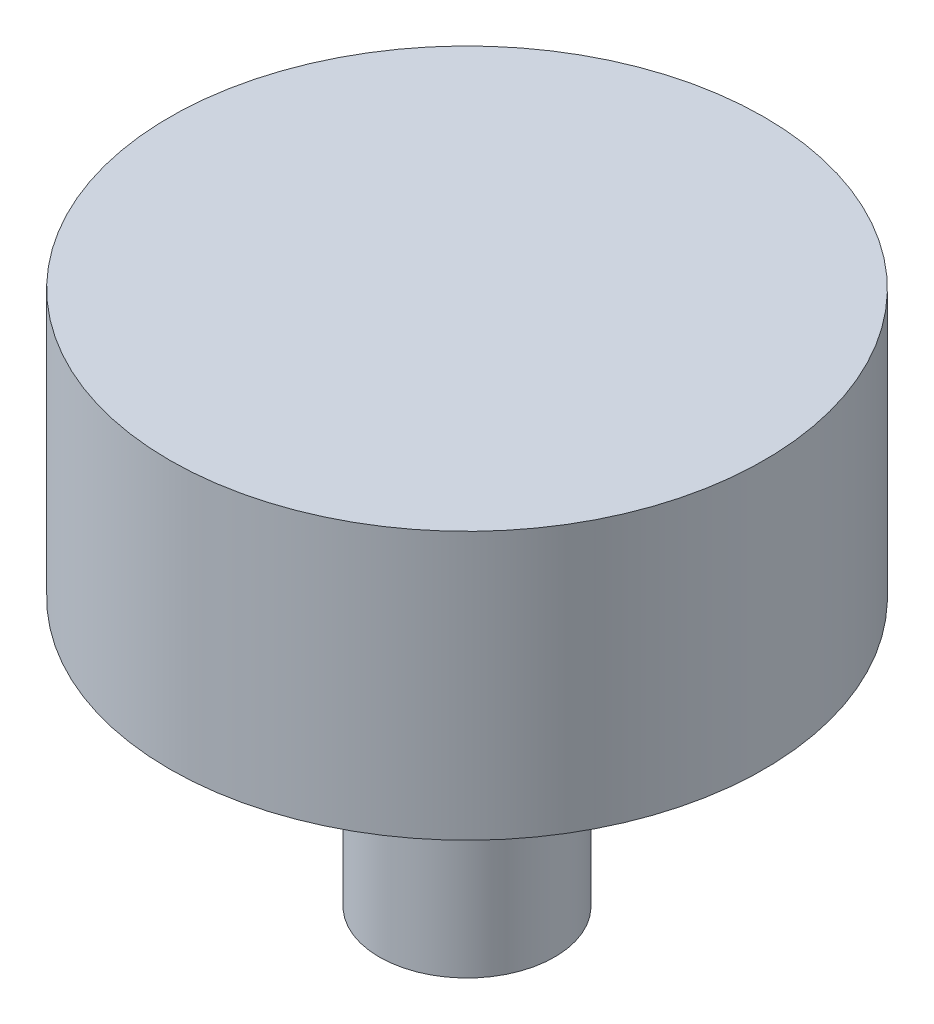
ISO-10303-21;
HEADER;
FILE_DESCRIPTION(('STEP AP214'),'2;1');
FILE_NAME('part.step','',(''),(''),'','','');
FILE_SCHEMA(('AUTOMOTIVE_DESIGN { 1 0 10303 214 1 1 1 1 }'));
ENDSEC;
DATA;
#1=APPLICATION_CONTEXT('core data for automotive mechanical design processes');
#2=APPLICATION_PROTOCOL_DEFINITION('international standard','automotive_design',2000,#1);
#3=PRODUCT_CONTEXT('',#1,'mechanical');
#4=PRODUCT('Part','Part','',(#3));
#5=PRODUCT_RELATED_PRODUCT_CATEGORY('part','',(#4));
#6=PRODUCT_DEFINITION_FORMATION('','',#4);
#7=PRODUCT_DEFINITION_CONTEXT('part definition',#1,'design');
#8=PRODUCT_DEFINITION('design','',#6,#7);
#9=PRODUCT_DEFINITION_SHAPE('','',#8);
#10=(LENGTH_UNIT() NAMED_UNIT(*) SI_UNIT(.MILLI.,.METRE.));
#11=(NAMED_UNIT(*) PLANE_ANGLE_UNIT() SI_UNIT($,.RADIAN.));
#12=(NAMED_UNIT(*) SI_UNIT($,.STERADIAN.) SOLID_ANGLE_UNIT());
#13=UNCERTAINTY_MEASURE_WITH_UNIT(LENGTH_MEASURE(1.E-05),#10,'distance_accuracy_value','');
#14=(GEOMETRIC_REPRESENTATION_CONTEXT(3) GLOBAL_UNCERTAINTY_ASSIGNED_CONTEXT((#13)) GLOBAL_UNIT_ASSIGNED_CONTEXT((#10,
#11,#12)) REPRESENTATION_CONTEXT('',''));
#15=CARTESIAN_POINT('',(0.,0.,0.));
#16=DIRECTION('',(0.,0.,1.));
#17=DIRECTION('',(1.,0.,0.));
#18=AXIS2_PLACEMENT_3D('',#15,#16,#17);
#19=CARTESIAN_POINT('',(0.,0.,0.));
#20=DIRECTION('',(0.,1.,0.));
#21=DIRECTION('',(0.,0.,1.));
#22=AXIS2_PLACEMENT_3D('',#19,#20,#21);
#23=PLANE('',#22);
#24=CARTESIAN_POINT('',(0.,0.,0.));
#25=DIRECTION('',(0.,1.,0.));
#26=DIRECTION('',(0.,0.,1.));
#27=AXIS2_PLACEMENT_3D('',#24,#25,#26);
#28=CIRCLE('',#27,2.95);
#29=CARTESIAN_POINT('',(0.,0.,2.95));
#30=VERTEX_POINT('',#29);
#31=EDGE_CURVE('E37',#30,#30,#28,.T.);
#32=ORIENTED_EDGE('',*,*,#31,.F.);
#33=EDGE_LOOP('',(#32));
#34=FACE_BOUND('',#33,.T.);
#35=CARTESIAN_POINT('',(0.,0.,0.));
#36=DIRECTION('',(0.,1.,0.));
#37=DIRECTION('',(0.,0.,1.));
#38=AXIS2_PLACEMENT_3D('',#35,#36,#37);
#39=CIRCLE('',#38,2.2);
#40=CARTESIAN_POINT('',(0.,0.,2.2));
#41=VERTEX_POINT('',#40);
#42=EDGE_CURVE('E44',#41,#41,#39,.T.);
#43=ORIENTED_EDGE('',*,*,#42,.T.);
#44=EDGE_LOOP('',(#43));
#45=FACE_BOUND('',#44,.T.);
#46=ADVANCED_FACE('F33',(#34,#45),#23,.F.);
#47=CARTESIAN_POINT('',(0.,9.,0.));
#48=DIRECTION('',(0.,-1.,0.));
#49=DIRECTION('',(0.,0.,-1.));
#50=AXIS2_PLACEMENT_3D('',#47,#48,#49);
#51=CYLINDRICAL_SURFACE('',#50,2.95);
#52=CARTESIAN_POINT('',(0.,9.,0.));
#53=DIRECTION('',(0.,1.,0.));
#54=DIRECTION('',(0.,0.,1.));
#55=AXIS2_PLACEMENT_3D('',#52,#53,#54);
#56=CIRCLE('',#55,2.95);
#57=CARTESIAN_POINT('',(0.,9.,2.95));
#58=VERTEX_POINT('',#57);
#59=EDGE_CURVE('E10',#58,#58,#56,.T.);
#60=ORIENTED_EDGE('',*,*,#59,.F.);
#61=EDGE_LOOP('',(#60));
#62=FACE_BOUND('',#61,.T.);
#63=ORIENTED_EDGE('',*,*,#31,.T.);
#64=EDGE_LOOP('',(#63));
#65=FACE_BOUND('',#64,.T.);
#66=ADVANCED_FACE('F35',(#62,#65),#51,.T.);
#67=CARTESIAN_POINT('',(0.,9.,0.));
#68=DIRECTION('',(0.,-1.,0.));
#69=DIRECTION('',(0.,0.,-1.));
#70=AXIS2_PLACEMENT_3D('',#67,#68,#69);
#71=CYLINDRICAL_SURFACE('',#70,2.2);
#72=CARTESIAN_POINT('',(0.,9.,0.));
#73=DIRECTION('',(0.,1.,0.));
#74=DIRECTION('',(0.,0.,1.));
#75=AXIS2_PLACEMENT_3D('',#72,#73,#74);
#76=CIRCLE('',#75,2.2);
#77=CARTESIAN_POINT('',(0.,9.,2.2));
#78=VERTEX_POINT('',#77);
#79=EDGE_CURVE('E48',#78,#78,#76,.T.);
#80=ORIENTED_EDGE('',*,*,#79,.T.);
#81=EDGE_LOOP('',(#80));
#82=FACE_BOUND('',#81,.T.);
#83=ORIENTED_EDGE('',*,*,#42,.F.);
#84=EDGE_LOOP('',(#83));
#85=FACE_BOUND('',#84,.T.);
#86=ADVANCED_FACE('F75',(#82,#85),#71,.F.);
#87=CARTESIAN_POINT('',(0.,9.,0.));
#88=DIRECTION('',(0.,1.,0.));
#89=DIRECTION('',(0.,0.,1.));
#90=AXIS2_PLACEMENT_3D('',#87,#88,#89);
#91=PLANE('',#90);
#92=ORIENTED_EDGE('',*,*,#79,.F.);
#93=EDGE_LOOP('',(#92));
#94=FACE_BOUND('',#93,.T.);
#95=ADVANCED_FACE('F63',(#94),#91,.F.);
#96=CARTESIAN_POINT('',(0.,18.,0.));
#97=DIRECTION('',(0.,-1.,0.));
#98=DIRECTION('',(0.,0.,-1.));
#99=AXIS2_PLACEMENT_3D('',#96,#97,#98);
#100=CYLINDRICAL_SURFACE('',#99,10.);
#101=CARTESIAN_POINT('',(0.,18.,0.));
#102=DIRECTION('',(0.,1.,0.));
#103=DIRECTION('',(0.,0.,1.));
#104=AXIS2_PLACEMENT_3D('',#101,#102,#103);
#105=CIRCLE('',#104,10.);
#106=CARTESIAN_POINT('',(0.,18.,10.));
#107=VERTEX_POINT('',#106);
#108=EDGE_CURVE('E51',#107,#107,#105,.T.);
#109=ORIENTED_EDGE('',*,*,#108,.F.);
#110=EDGE_LOOP('',(#109));
#111=FACE_BOUND('',#110,.T.);
#112=CARTESIAN_POINT('',(0.,9.,0.));
#113=DIRECTION('',(0.,1.,0.));
#114=DIRECTION('',(0.,0.,1.));
#115=AXIS2_PLACEMENT_3D('',#112,#113,#114);
#116=CIRCLE('',#115,10.);
#117=CARTESIAN_POINT('',(0.,9.,10.));
#118=VERTEX_POINT('',#117);
#119=EDGE_CURVE('E52',#118,#118,#116,.T.);
#120=ORIENTED_EDGE('',*,*,#119,.T.);
#121=EDGE_LOOP('',(#120));
#122=FACE_BOUND('',#121,.T.);
#123=ADVANCED_FACE('F60',(#111,#122),#100,.T.);
#124=CARTESIAN_POINT('',(0.,18.,0.));
#125=DIRECTION('',(0.,1.,0.));
#126=DIRECTION('',(0.,0.,1.));
#127=AXIS2_PLACEMENT_3D('',#124,#125,#126);
#128=PLANE('',#127);
#129=ORIENTED_EDGE('',*,*,#108,.T.);
#130=EDGE_LOOP('',(#129));
#131=FACE_BOUND('',#130,.T.);
#132=ADVANCED_FACE('F58',(#131),#128,.T.);
#133=ORIENTED_EDGE('',*,*,#59,.T.);
#134=EDGE_LOOP('',(#133));
#135=FACE_BOUND('',#134,.T.);
#136=ORIENTED_EDGE('',*,*,#119,.F.);
#137=EDGE_LOOP('',(#136));
#138=FACE_BOUND('',#137,.T.);
#139=ADVANCED_FACE('F67',(#135,#138),#91,.F.);
#140=CLOSED_SHELL('',(#46,#66,#86,#95,#123,#132,#139));
#141=MANIFOLD_SOLID_BREP('B2',#140);
#142=ADVANCED_BREP_SHAPE_REPRESENTATION('',(#18,#141),#14);
#143=SHAPE_DEFINITION_REPRESENTATION(#9,#142);
ENDSEC;
END-ISO-10303-21;
